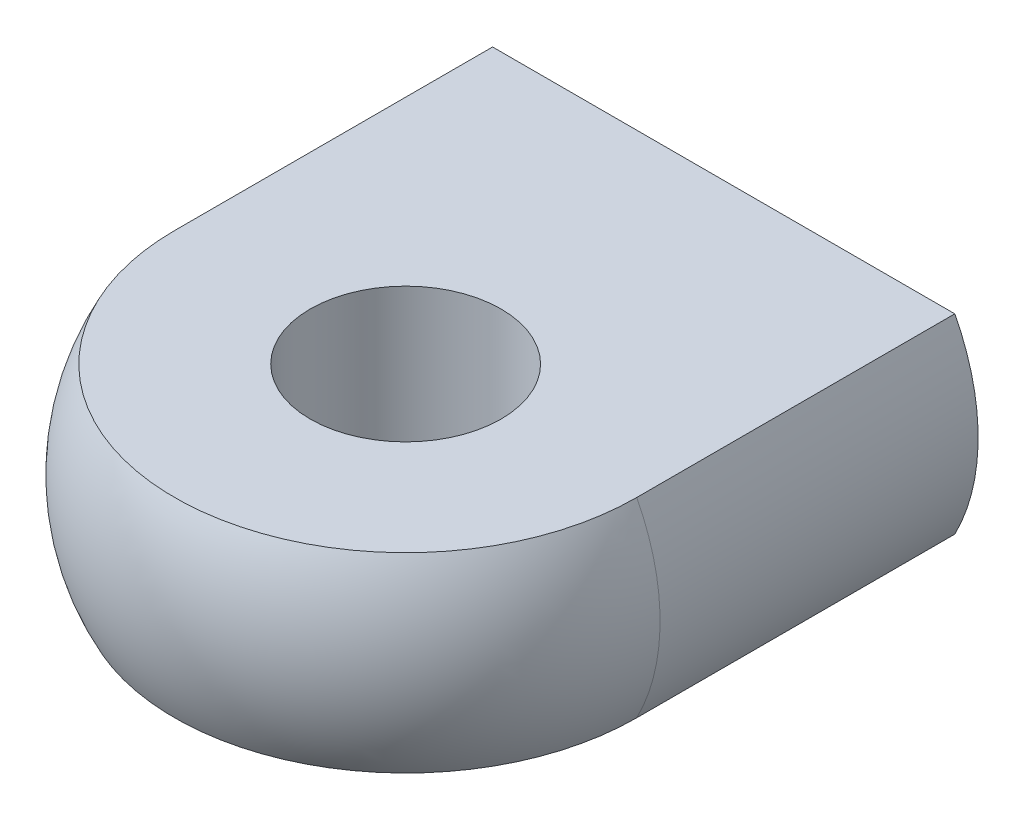
ISO-10303-21;
HEADER;
FILE_DESCRIPTION(('STEP AP214'),'2;1');
FILE_NAME('part.step','',(''),(''),'','','');
FILE_SCHEMA(('AUTOMOTIVE_DESIGN { 1 0 10303 214 1 1 1 1 }'));
ENDSEC;
DATA;
#1=APPLICATION_CONTEXT('core data for automotive mechanical design processes');
#2=APPLICATION_PROTOCOL_DEFINITION('international standard','automotive_design',2000,#1);
#3=PRODUCT_CONTEXT('',#1,'mechanical');
#4=PRODUCT('Part','Part','',(#3));
#5=PRODUCT_RELATED_PRODUCT_CATEGORY('part','',(#4));
#6=PRODUCT_DEFINITION_FORMATION('','',#4);
#7=PRODUCT_DEFINITION_CONTEXT('part definition',#1,'design');
#8=PRODUCT_DEFINITION('design','',#6,#7);
#9=PRODUCT_DEFINITION_SHAPE('','',#8);
#10=(LENGTH_UNIT() NAMED_UNIT(*) SI_UNIT(.MILLI.,.METRE.));
#11=(NAMED_UNIT(*) PLANE_ANGLE_UNIT() SI_UNIT($,.RADIAN.));
#12=(NAMED_UNIT(*) SI_UNIT($,.STERADIAN.) SOLID_ANGLE_UNIT());
#13=UNCERTAINTY_MEASURE_WITH_UNIT(LENGTH_MEASURE(1.E-05),#10,'distance_accuracy_value','');
#14=(GEOMETRIC_REPRESENTATION_CONTEXT(3) GLOBAL_UNCERTAINTY_ASSIGNED_CONTEXT((#13)) GLOBAL_UNIT_ASSIGNED_CONTEXT((#10,
#11,#12)) REPRESENTATION_CONTEXT('',''));
#15=CARTESIAN_POINT('',(0.,0.,0.));
#16=DIRECTION('',(0.,0.,1.));
#17=DIRECTION('',(1.,0.,0.));
#18=AXIS2_PLACEMENT_3D('',#15,#16,#17);
#19=CARTESIAN_POINT('',(1.5,0.,0.));
#20=DIRECTION('',(0.,0.,-1.));
#21=DIRECTION('',(-1.,0.,0.));
#22=AXIS2_PLACEMENT_3D('',#19,#20,#21);
#23=PLANE('',#22);
#24=CARTESIAN_POINT('',(-5.,0.,0.));
#25=DIRECTION('',(0.,0.,-1.));
#26=DIRECTION('',(-1.,0.,0.));
#27=AXIS2_PLACEMENT_3D('',#24,#25,#26);
#28=CIRCLE('',#27,1.49999999976672);
#29=CARTESIAN_POINT('',(-6.49999999976672,0.,0.));
#30=VERTEX_POINT('',#29);
#31=EDGE_CURVE('E54',#30,#30,#28,.F.);
#32=ORIENTED_EDGE('',*,*,#31,.T.);
#33=EDGE_LOOP('',(#32));
#34=FACE_BOUND('',#33,.T.);
#35=CARTESIAN_POINT('',(5.,0.,0.));
#36=DIRECTION('',(0.,0.,-1.));
#37=DIRECTION('',(-1.,0.,0.));
#38=AXIS2_PLACEMENT_3D('',#35,#36,#37);
#39=CIRCLE('',#38,1.49999999976672);
#40=CARTESIAN_POINT('',(3.50000000023328,0.,0.));
#41=VERTEX_POINT('',#40);
#42=EDGE_CURVE('E184',#41,#41,#39,.F.);
#43=ORIENTED_EDGE('',*,*,#42,.T.);
#44=EDGE_LOOP('',(#43));
#45=FACE_BOUND('',#44,.T.);
#46=DIRECTION('',(-1.,0.,0.));
#47=VECTOR('',#46,1.);
#48=CARTESIAN_POINT('',(1.5,3.,0.));
#49=LINE('',#48,#47);
#50=CARTESIAN_POINT('',(-7.2662812973354,3.,0.));
#51=VERTEX_POINT('',#50);
#52=CARTESIAN_POINT('',(7.2662812973354,3.,0.));
#53=VERTEX_POINT('',#52);
#54=EDGE_CURVE('E107',#51,#53,#49,.F.);
#55=ORIENTED_EDGE('',*,*,#54,.T.);
#56=CARTESIAN_POINT('',(1.5,0.,0.));
#57=DIRECTION('',(0.,0.,-1.));
#58=DIRECTION('',(-1.,0.,0.));
#59=AXIS2_PLACEMENT_3D('',#56,#57,#58);
#60=CIRCLE('',#59,6.5);
#61=CARTESIAN_POINT('',(7.2662812973354,-3.,0.));
#62=VERTEX_POINT('',#61);
#63=EDGE_CURVE('E254',#53,#62,#60,.T.);
#64=ORIENTED_EDGE('',*,*,#63,.T.);
#65=DIRECTION('',(1.,0.,0.));
#66=VECTOR('',#65,1.);
#67=CARTESIAN_POINT('',(0.,-3.,0.));
#68=LINE('',#67,#66);
#69=CARTESIAN_POINT('',(-7.2662812973354,-3.,0.));
#70=VERTEX_POINT('',#69);
#71=EDGE_CURVE('E121',#70,#62,#68,.T.);
#72=ORIENTED_EDGE('',*,*,#71,.F.);
#73=CARTESIAN_POINT('',(-1.5,0.,0.));
#74=DIRECTION('',(0.,0.,-1.));
#75=DIRECTION('',(-1.,0.,0.));
#76=AXIS2_PLACEMENT_3D('',#73,#74,#75);
#77=CIRCLE('',#76,6.5);
#78=EDGE_CURVE('E70',#70,#51,#77,.T.);
#79=ORIENTED_EDGE('',*,*,#78,.T.);
#80=EDGE_LOOP('',(#55,#64,#72,#79));
#81=FACE_BOUND('',#80,.T.);
#82=DIRECTION('',(1.,0.,0.));
#83=VECTOR('',#82,1.);
#84=CARTESIAN_POINT('',(-2.25,2.,0.));
#85=LINE('',#84,#83);
#86=CARTESIAN_POINT('',(-2.25,2.,0.));
#87=VERTEX_POINT('',#86);
#88=CARTESIAN_POINT('',(2.25,2.,0.));
#89=VERTEX_POINT('',#88);
#90=EDGE_CURVE('E200',#87,#89,#85,.T.);
#91=ORIENTED_EDGE('',*,*,#90,.F.);
#92=DIRECTION('',(0.,1.,0.));
#93=VECTOR('',#92,1.);
#94=CARTESIAN_POINT('',(-2.25,-2.,0.));
#95=LINE('',#94,#93);
#96=CARTESIAN_POINT('',(-2.25,-2.,0.));
#97=VERTEX_POINT('',#96);
#98=EDGE_CURVE('E204',#97,#87,#95,.T.);
#99=ORIENTED_EDGE('',*,*,#98,.F.);
#100=DIRECTION('',(1.,0.,0.));
#101=VECTOR('',#100,1.);
#102=CARTESIAN_POINT('',(-2.25,-2.,0.));
#103=LINE('',#102,#101);
#104=CARTESIAN_POINT('',(2.25,-2.,0.));
#105=VERTEX_POINT('',#104);
#106=EDGE_CURVE('E210',#97,#105,#103,.T.);
#107=ORIENTED_EDGE('',*,*,#106,.T.);
#108=DIRECTION('',(0.,1.,0.));
#109=VECTOR('',#108,1.);
#110=CARTESIAN_POINT('',(2.25,-2.,0.));
#111=LINE('',#110,#109);
#112=EDGE_CURVE('E205',#105,#89,#111,.T.);
#113=ORIENTED_EDGE('',*,*,#112,.T.);
#114=EDGE_LOOP('',(#91,#99,#107,#113));
#115=FACE_BOUND('',#114,.T.);
#116=ADVANCED_FACE('F46',(#34,#45,#81,#115),#23,.T.);
#117=CARTESIAN_POINT('',(0.,3.,9.));
#118=DIRECTION('',(0.,1.,0.));
#119=DIRECTION('',(0.,0.,1.));
#120=AXIS2_PLACEMENT_3D('',#117,#118,#119);
#121=PLANE('',#120);
#122=DIRECTION('',(0.,0.,-1.));
#123=VECTOR('',#122,1.);
#124=CARTESIAN_POINT('',(-7.2662812973354,3.,5.));
#125=LINE('',#124,#123);
#126=CARTESIAN_POINT('',(-7.2662812973356,2.99999999999957,10.));
#127=VERTEX_POINT('',#126);
#128=EDGE_CURVE('E103',#127,#51,#125,.T.);
#129=ORIENTED_EDGE('',*,*,#128,.F.);
#130=CARTESIAN_POINT('',(-1.42279385990967E-13,2.99999999999959,10.));
#131=DIRECTION('',(0.,1.,0.));
#132=DIRECTION('',(-1.,0.,0.));
#133=AXIS2_PLACEMENT_3D('',#130,#131,#132);
#134=CIRCLE('',#133,7.2662812973356);
#135=CARTESIAN_POINT('',(7.26628129733543,3.00000000000003,10.0000000000001));
#136=VERTEX_POINT('',#135);
#137=EDGE_CURVE('E90',#136,#127,#134,.F.);
#138=ORIENTED_EDGE('',*,*,#137,.F.);
#139=DIRECTION('',(0.,0.,-1.));
#140=VECTOR('',#139,1.);
#141=CARTESIAN_POINT('',(7.2662812973354,3.,5.));
#142=LINE('',#141,#140);
#143=EDGE_CURVE('E213',#53,#136,#142,.F.);
#144=ORIENTED_EDGE('',*,*,#143,.F.);
#145=ORIENTED_EDGE('',*,*,#54,.F.);
#146=EDGE_LOOP('',(#129,#138,#144,#145));
#147=FACE_BOUND('',#146,.T.);
#148=CARTESIAN_POINT('',(0.,3.,10.));
#149=DIRECTION('',(0.,1.,0.));
#150=DIRECTION('',(0.,0.,1.));
#151=AXIS2_PLACEMENT_3D('',#148,#149,#150);
#152=CIRCLE('',#151,3.);
#153=CARTESIAN_POINT('',(0.,3.,13.));
#154=VERTEX_POINT('',#153);
#155=EDGE_CURVE('E475',#154,#154,#152,.T.);
#156=ORIENTED_EDGE('',*,*,#155,.F.);
#157=EDGE_LOOP('',(#156));
#158=FACE_BOUND('',#157,.T.);
#159=ADVANCED_FACE('F104',(#147,#158),#121,.T.);
#160=CARTESIAN_POINT('',(1.5,0.,5.));
#161=DIRECTION('',(0.,0.,-1.));
#162=DIRECTION('',(-1.,0.,0.));
#163=AXIS2_PLACEMENT_3D('',#160,#161,#162);
#164=CYLINDRICAL_SURFACE('',#163,6.5);
#165=CARTESIAN_POINT('',(1.50000000000001,0.,10.));
#166=DIRECTION('',(0.,0.,1.));
#167=DIRECTION('',(0.,-1.,0.));
#168=AXIS2_PLACEMENT_3D('',#165,#166,#167);
#169=CIRCLE('',#168,6.50000000000003);
#170=CARTESIAN_POINT('',(7.26628129733563,-2.99999999999956,10.));
#171=VERTEX_POINT('',#170);
#172=EDGE_CURVE('E97',#171,#136,#169,.T.);
#173=ORIENTED_EDGE('',*,*,#172,.F.);
#174=DIRECTION('',(0.,0.,-1.));
#175=VECTOR('',#174,1.);
#176=CARTESIAN_POINT('',(7.2662812973354,-3.,9.));
#177=LINE('',#176,#175);
#178=EDGE_CURVE('E225',#62,#171,#177,.F.);
#179=ORIENTED_EDGE('',*,*,#178,.F.);
#180=ORIENTED_EDGE('',*,*,#63,.F.);
#181=ORIENTED_EDGE('',*,*,#143,.T.);
#182=EDGE_LOOP('',(#173,#179,#180,#181));
#183=FACE_BOUND('',#182,.T.);
#184=ADVANCED_FACE('F157',(#183),#164,.T.);
#185=CARTESIAN_POINT('',(0.,0.,9.99999999999999));
#186=DIRECTION('',(0.,1.,0.));
#187=DIRECTION('',(-1.,0.,0.));
#188=AXIS2_PLACEMENT_3D('',#185,#186,#187);
#189=DEGENERATE_TOROIDAL_SURFACE('',#188,1.49999999999995,6.50000000000004,.T.);
#190=ORIENTED_EDGE('',*,*,#137,.T.);
#191=CARTESIAN_POINT('',(-1.5,0.,10.));
#192=DIRECTION('',(0.,0.,-1.));
#193=DIRECTION('',(-1.,0.,0.));
#194=AXIS2_PLACEMENT_3D('',#191,#192,#193);
#195=CIRCLE('',#194,6.5);
#196=CARTESIAN_POINT('',(-7.2662812973354,-3.,9.99999999999997));
#197=VERTEX_POINT('',#196);
#198=EDGE_CURVE('E95',#197,#127,#195,.T.);
#199=ORIENTED_EDGE('',*,*,#198,.F.);
#200=CARTESIAN_POINT('',(2.21912496254605E-13,-2.99999999999957,9.99999999999994));
#201=DIRECTION('',(0.,1.,0.));
#202=DIRECTION('',(-1.,0.,0.));
#203=AXIS2_PLACEMENT_3D('',#200,#201,#202);
#204=CIRCLE('',#203,7.26628129733564);
#205=EDGE_CURVE('E224',#171,#197,#204,.F.);
#206=ORIENTED_EDGE('',*,*,#205,.F.);
#207=ORIENTED_EDGE('',*,*,#172,.T.);
#208=EDGE_LOOP('',(#190,#199,#206,#207));
#209=FACE_BOUND('',#208,.T.);
#210=ADVANCED_FACE('F92',(#209),#189,.T.);
#211=CARTESIAN_POINT('',(-1.5,0.,5.));
#212=DIRECTION('',(0.,0.,-1.));
#213=DIRECTION('',(-1.,0.,0.));
#214=AXIS2_PLACEMENT_3D('',#211,#212,#213);
#215=CYLINDRICAL_SURFACE('',#214,6.5);
#216=ORIENTED_EDGE('',*,*,#78,.F.);
#217=DIRECTION('',(0.,0.,-1.));
#218=VECTOR('',#217,1.);
#219=CARTESIAN_POINT('',(-7.2662812973354,-3.,9.));
#220=LINE('',#219,#218);
#221=EDGE_CURVE('E112',#197,#70,#220,.T.);
#222=ORIENTED_EDGE('',*,*,#221,.F.);
#223=ORIENTED_EDGE('',*,*,#198,.T.);
#224=ORIENTED_EDGE('',*,*,#128,.T.);
#225=EDGE_LOOP('',(#216,#222,#223,#224));
#226=FACE_BOUND('',#225,.T.);
#227=ADVANCED_FACE('F110',(#226),#215,.T.);
#228=CARTESIAN_POINT('',(0.,-3.,9.));
#229=DIRECTION('',(0.,-1.,0.));
#230=DIRECTION('',(0.,0.,-1.));
#231=AXIS2_PLACEMENT_3D('',#228,#229,#230);
#232=PLANE('',#231);
#233=ORIENTED_EDGE('',*,*,#221,.T.);
#234=ORIENTED_EDGE('',*,*,#71,.T.);
#235=ORIENTED_EDGE('',*,*,#178,.T.);
#236=ORIENTED_EDGE('',*,*,#205,.T.);
#237=EDGE_LOOP('',(#233,#234,#235,#236));
#238=FACE_BOUND('',#237,.T.);
#239=CARTESIAN_POINT('',(0.,-3.,10.));
#240=DIRECTION('',(0.,-1.,0.));
#241=DIRECTION('',(0.,0.,-1.));
#242=AXIS2_PLACEMENT_3D('',#239,#240,#241);
#243=CIRCLE('',#242,3.);
#244=CARTESIAN_POINT('',(0.,-3.,7.));
#245=VERTEX_POINT('',#244);
#246=EDGE_CURVE('E478',#245,#245,#243,.F.);
#247=ORIENTED_EDGE('',*,*,#246,.T.);
#248=EDGE_LOOP('',(#247));
#249=FACE_BOUND('',#248,.T.);
#250=ADVANCED_FACE('F144',(#238,#249),#232,.T.);
#251=CARTESIAN_POINT('',(-2.25,2.,4.));
#252=DIRECTION('',(0.,0.,1.));
#253=DIRECTION('',(1.,0.,0.));
#254=AXIS2_PLACEMENT_3D('',#251,#252,#253);
#255=PLANE('',#254);
#256=DIRECTION('',(0.,-1.,0.));
#257=VECTOR('',#256,1.);
#258=CARTESIAN_POINT('',(2.25,2.,4.));
#259=LINE('',#258,#257);
#260=CARTESIAN_POINT('',(2.25,2.,4.));
#261=VERTEX_POINT('',#260);
#262=CARTESIAN_POINT('',(2.25,-2.,4.));
#263=VERTEX_POINT('',#262);
#264=EDGE_CURVE('E489',#261,#263,#259,.T.);
#265=ORIENTED_EDGE('',*,*,#264,.T.);
#266=DIRECTION('',(1.,0.,0.));
#267=VECTOR('',#266,1.);
#268=CARTESIAN_POINT('',(-2.25,-2.,4.));
#269=LINE('',#268,#267);
#270=CARTESIAN_POINT('',(-2.25,-2.,4.));
#271=VERTEX_POINT('',#270);
#272=EDGE_CURVE('E215',#271,#263,#269,.T.);
#273=ORIENTED_EDGE('',*,*,#272,.F.);
#274=DIRECTION('',(0.,-1.,0.));
#275=VECTOR('',#274,1.);
#276=CARTESIAN_POINT('',(-2.25,2.,4.));
#277=LINE('',#276,#275);
#278=CARTESIAN_POINT('',(-2.25,2.,4.));
#279=VERTEX_POINT('',#278);
#280=EDGE_CURVE('E490',#279,#271,#277,.T.);
#281=ORIENTED_EDGE('',*,*,#280,.F.);
#282=DIRECTION('',(1.,0.,0.));
#283=VECTOR('',#282,1.);
#284=CARTESIAN_POINT('',(-2.25,2.,4.));
#285=LINE('',#284,#283);
#286=EDGE_CURVE('E209',#279,#261,#285,.T.);
#287=ORIENTED_EDGE('',*,*,#286,.T.);
#288=EDGE_LOOP('',(#265,#273,#281,#287));
#289=FACE_BOUND('',#288,.T.);
#290=ADVANCED_FACE('F149',(#289),#255,.F.);
#291=CARTESIAN_POINT('',(-2.25,2.,0.));
#292=DIRECTION('',(0.,1.,0.));
#293=DIRECTION('',(0.,0.,1.));
#294=AXIS2_PLACEMENT_3D('',#291,#292,#293);
#295=PLANE('',#294);
#296=DIRECTION('',(0.,0.,1.));
#297=VECTOR('',#296,1.);
#298=CARTESIAN_POINT('',(2.25,2.,0.));
#299=LINE('',#298,#297);
#300=EDGE_CURVE('E61',#89,#261,#299,.T.);
#301=ORIENTED_EDGE('',*,*,#300,.T.);
#302=ORIENTED_EDGE('',*,*,#286,.F.);
#303=DIRECTION('',(0.,0.,1.));
#304=VECTOR('',#303,1.);
#305=CARTESIAN_POINT('',(-2.25,2.,0.));
#306=LINE('',#305,#304);
#307=EDGE_CURVE('E220',#87,#279,#306,.T.);
#308=ORIENTED_EDGE('',*,*,#307,.F.);
#309=ORIENTED_EDGE('',*,*,#90,.T.);
#310=EDGE_LOOP('',(#301,#302,#308,#309));
#311=FACE_BOUND('',#310,.T.);
#312=ADVANCED_FACE('F382',(#311),#295,.F.);
#313=CARTESIAN_POINT('',(-2.25,-2.,4.));
#314=DIRECTION('',(0.,-1.,0.));
#315=DIRECTION('',(0.,0.,-1.));
#316=AXIS2_PLACEMENT_3D('',#313,#314,#315);
#317=PLANE('',#316);
#318=DIRECTION('',(0.,0.,-1.));
#319=VECTOR('',#318,1.);
#320=CARTESIAN_POINT('',(2.25,-2.,4.));
#321=LINE('',#320,#319);
#322=EDGE_CURVE('E501',#263,#105,#321,.T.);
#323=ORIENTED_EDGE('',*,*,#322,.T.);
#324=ORIENTED_EDGE('',*,*,#106,.F.);
#325=DIRECTION('',(0.,0.,-1.));
#326=VECTOR('',#325,1.);
#327=CARTESIAN_POINT('',(-2.25,-2.,4.));
#328=LINE('',#327,#326);
#329=EDGE_CURVE('E493',#271,#97,#328,.T.);
#330=ORIENTED_EDGE('',*,*,#329,.F.);
#331=ORIENTED_EDGE('',*,*,#272,.T.);
#332=EDGE_LOOP('',(#323,#324,#330,#331));
#333=FACE_BOUND('',#332,.T.);
#334=ADVANCED_FACE('F390',(#333),#317,.F.);
#335=CARTESIAN_POINT('',(-2.25,0.,0.));
#336=DIRECTION('',(1.,0.,0.));
#337=DIRECTION('',(0.,0.,-1.));
#338=AXIS2_PLACEMENT_3D('',#335,#336,#337);
#339=PLANE('',#338);
#340=ORIENTED_EDGE('',*,*,#280,.T.);
#341=ORIENTED_EDGE('',*,*,#329,.T.);
#342=ORIENTED_EDGE('',*,*,#98,.T.);
#343=ORIENTED_EDGE('',*,*,#307,.T.);
#344=EDGE_LOOP('',(#340,#341,#342,#343));
#345=FACE_BOUND('',#344,.T.);
#346=ADVANCED_FACE('F398',(#345),#339,.T.);
#347=CARTESIAN_POINT('',(2.25,0.,0.));
#348=DIRECTION('',(1.,0.,0.));
#349=DIRECTION('',(0.,0.,-1.));
#350=AXIS2_PLACEMENT_3D('',#347,#348,#349);
#351=PLANE('',#350);
#352=ORIENTED_EDGE('',*,*,#264,.F.);
#353=ORIENTED_EDGE('',*,*,#300,.F.);
#354=ORIENTED_EDGE('',*,*,#112,.F.);
#355=ORIENTED_EDGE('',*,*,#322,.F.);
#356=EDGE_LOOP('',(#352,#353,#354,#355));
#357=FACE_BOUND('',#356,.T.);
#358=ADVANCED_FACE('F406',(#357),#351,.F.);
#359=CARTESIAN_POINT('',(-5.,0.,6.50000000000001));
#360=DIRECTION('',(0.,0.,-1.));
#361=DIRECTION('',(-1.,0.,0.));
#362=AXIS2_PLACEMENT_3D('',#359,#360,#361);
#363=CONICAL_SURFACE('',#362,1.25,1.04719754984807);
#364=CARTESIAN_POINT('',(-5.,0.,7.22168783873459));
#365=VERTEX_POINT('',#364);
#366=VERTEX_LOOP('',#365);
#367=FACE_BOUND('',#366,.T.);
#368=CARTESIAN_POINT('',(-5.,0.,6.50000000000001));
#369=DIRECTION('',(0.,0.,-1.));
#370=DIRECTION('',(-1.,0.,0.));
#371=AXIS2_PLACEMENT_3D('',#368,#369,#370);
#372=CIRCLE('',#371,1.25);
#373=CARTESIAN_POINT('',(-6.25,0.,6.50000000000001));
#374=VERTEX_POINT('',#373);
#375=EDGE_CURVE('E483',#374,#374,#372,.T.);
#376=ORIENTED_EDGE('',*,*,#375,.T.);
#377=EDGE_LOOP('',(#376));
#378=FACE_BOUND('',#377,.T.);
#379=ADVANCED_FACE('F415',(#367,#378),#363,.F.);
#380=CARTESIAN_POINT('',(-5.,0.,0.));
#381=DIRECTION('',(0.,0.,-1.));
#382=DIRECTION('',(-1.,0.,0.));
#383=AXIS2_PLACEMENT_3D('',#380,#381,#382);
#384=CYLINDRICAL_SURFACE('',#383,1.25);
#385=CARTESIAN_POINT('',(-5.,0.,0.25000000022146));
#386=DIRECTION('',(0.,0.,-1.));
#387=DIRECTION('',(-1.,0.,0.));
#388=AXIS2_PLACEMENT_3D('',#385,#386,#387);
#389=CIRCLE('',#388,1.25);
#390=CARTESIAN_POINT('',(-6.25,0.,0.25000000022146));
#391=VERTEX_POINT('',#390);
#392=EDGE_CURVE('E182',#391,#391,#389,.T.);
#393=ORIENTED_EDGE('',*,*,#392,.T.);
#394=EDGE_LOOP('',(#393));
#395=FACE_BOUND('',#394,.T.);
#396=ORIENTED_EDGE('',*,*,#375,.F.);
#397=EDGE_LOOP('',(#396));
#398=FACE_BOUND('',#397,.T.);
#399=ADVANCED_FACE('F423',(#395,#398),#384,.F.);
#400=CARTESIAN_POINT('',(5.,0.,6.50000000000001));
#401=DIRECTION('',(0.,0.,-1.));
#402=DIRECTION('',(-1.,0.,0.));
#403=AXIS2_PLACEMENT_3D('',#400,#401,#402);
#404=CONICAL_SURFACE('',#403,1.25,1.04719754984807);
#405=CARTESIAN_POINT('',(5.,0.,7.22168783873459));
#406=VERTEX_POINT('',#405);
#407=VERTEX_LOOP('',#406);
#408=FACE_BOUND('',#407,.T.);
#409=CARTESIAN_POINT('',(5.,0.,6.50000000000001));
#410=DIRECTION('',(0.,0.,-1.));
#411=DIRECTION('',(-1.,0.,0.));
#412=AXIS2_PLACEMENT_3D('',#409,#410,#411);
#413=CIRCLE('',#412,1.25);
#414=CARTESIAN_POINT('',(3.75,0.,6.50000000000001));
#415=VERTEX_POINT('',#414);
#416=EDGE_CURVE('E480',#415,#415,#413,.T.);
#417=ORIENTED_EDGE('',*,*,#416,.T.);
#418=EDGE_LOOP('',(#417));
#419=FACE_BOUND('',#418,.T.);
#420=ADVANCED_FACE('F174',(#408,#419),#404,.F.);
#421=CARTESIAN_POINT('',(5.,0.,0.));
#422=DIRECTION('',(0.,0.,-1.));
#423=DIRECTION('',(-1.,0.,0.));
#424=AXIS2_PLACEMENT_3D('',#421,#422,#423);
#425=CYLINDRICAL_SURFACE('',#424,1.25);
#426=CARTESIAN_POINT('',(5.,0.,0.25000000022146));
#427=DIRECTION('',(0.,0.,-1.));
#428=DIRECTION('',(-1.,0.,0.));
#429=AXIS2_PLACEMENT_3D('',#426,#427,#428);
#430=CIRCLE('',#429,1.25);
#431=CARTESIAN_POINT('',(3.75,0.,0.25000000022146));
#432=VERTEX_POINT('',#431);
#433=EDGE_CURVE('E13',#432,#432,#430,.T.);
#434=ORIENTED_EDGE('',*,*,#433,.T.);
#435=EDGE_LOOP('',(#434));
#436=FACE_BOUND('',#435,.T.);
#437=ORIENTED_EDGE('',*,*,#416,.F.);
#438=EDGE_LOOP('',(#437));
#439=FACE_BOUND('',#438,.T.);
#440=ADVANCED_FACE('F166',(#436,#439),#425,.F.);
#441=CARTESIAN_POINT('',(-5.,0.,0.25000000022146));
#442=DIRECTION('',(0.,0.,-1.));
#443=DIRECTION('',(-1.,0.,0.));
#444=AXIS2_PLACEMENT_3D('',#441,#442,#443);
#445=CONICAL_SURFACE('',#444,1.25,0.785398162487958);
#446=ORIENTED_EDGE('',*,*,#31,.F.);
#447=EDGE_LOOP('',(#446));
#448=FACE_BOUND('',#447,.T.);
#449=ORIENTED_EDGE('',*,*,#392,.F.);
#450=EDGE_LOOP('',(#449));
#451=FACE_BOUND('',#450,.T.);
#452=ADVANCED_FACE('F164',(#448,#451),#445,.F.);
#453=CARTESIAN_POINT('',(5.,0.,0.25000000022146));
#454=DIRECTION('',(0.,0.,-1.));
#455=DIRECTION('',(-1.,0.,0.));
#456=AXIS2_PLACEMENT_3D('',#453,#454,#455);
#457=CONICAL_SURFACE('',#456,1.25,0.785398162487958);
#458=ORIENTED_EDGE('',*,*,#42,.F.);
#459=EDGE_LOOP('',(#458));
#460=FACE_BOUND('',#459,.T.);
#461=ORIENTED_EDGE('',*,*,#433,.F.);
#462=EDGE_LOOP('',(#461));
#463=FACE_BOUND('',#462,.T.);
#464=ADVANCED_FACE('F48',(#460,#463),#457,.F.);
#465=CARTESIAN_POINT('',(0.,-16.4344172692076,10.));
#466=DIRECTION('',(0.,1.,0.));
#467=DIRECTION('',(0.,0.,1.));
#468=AXIS2_PLACEMENT_3D('',#465,#466,#467);
#469=CYLINDRICAL_SURFACE('',#468,3.);
#470=ORIENTED_EDGE('',*,*,#155,.T.);
#471=EDGE_LOOP('',(#470));
#472=FACE_BOUND('',#471,.T.);
#473=ORIENTED_EDGE('',*,*,#246,.F.);
#474=EDGE_LOOP('',(#473));
#475=FACE_BOUND('',#474,.T.);
#476=ADVANCED_FACE('F172',(#472,#475),#469,.F.);
#477=CLOSED_SHELL('',(#116,#159,#184,#210,#227,#250,#290,#312,#334,#346,#358,#379,#399,#420,
#440,#452,#464,#476));
#478=MANIFOLD_SOLID_BREP('B2',#477);
#479=ADVANCED_BREP_SHAPE_REPRESENTATION('',(#18,#478),#14);
#480=SHAPE_DEFINITION_REPRESENTATION(#9,#479);
ENDSEC;
END-ISO-10303-21;
